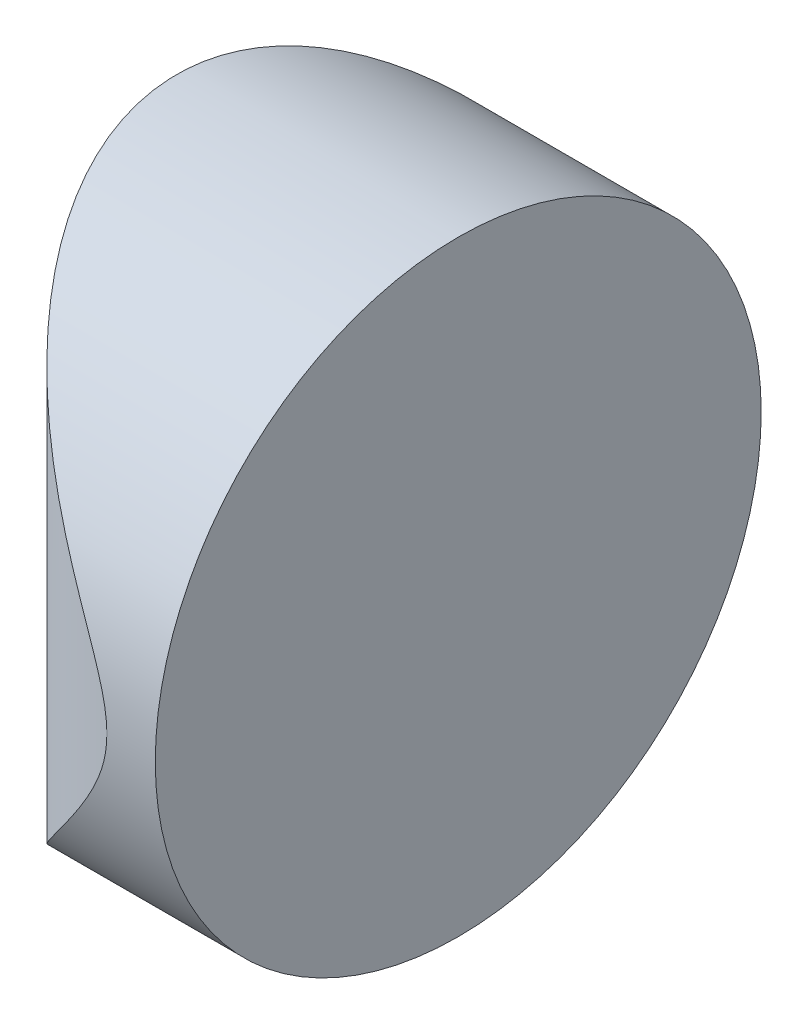
ISO-10303-21;
HEADER;
FILE_DESCRIPTION(('STEP AP214'),'2;1');
FILE_NAME('part.step','',(''),(''),'','','');
FILE_SCHEMA(('AUTOMOTIVE_DESIGN { 1 0 10303 214 1 1 1 1 }'));
ENDSEC;
DATA;
#1=APPLICATION_CONTEXT('core data for automotive mechanical design processes');
#2=APPLICATION_PROTOCOL_DEFINITION('international standard','automotive_design',2000,#1);
#3=PRODUCT_CONTEXT('',#1,'mechanical');
#4=PRODUCT('Part','Part','',(#3));
#5=PRODUCT_RELATED_PRODUCT_CATEGORY('part','',(#4));
#6=PRODUCT_DEFINITION_FORMATION('','',#4);
#7=PRODUCT_DEFINITION_CONTEXT('part definition',#1,'design');
#8=PRODUCT_DEFINITION('design','',#6,#7);
#9=PRODUCT_DEFINITION_SHAPE('','',#8);
#10=(LENGTH_UNIT() NAMED_UNIT(*) SI_UNIT(.MILLI.,.METRE.));
#11=(NAMED_UNIT(*) PLANE_ANGLE_UNIT() SI_UNIT($,.RADIAN.));
#12=(NAMED_UNIT(*) SI_UNIT($,.STERADIAN.) SOLID_ANGLE_UNIT());
#13=UNCERTAINTY_MEASURE_WITH_UNIT(LENGTH_MEASURE(1.E-05),#10,'distance_accuracy_value','');
#14=(GEOMETRIC_REPRESENTATION_CONTEXT(3) GLOBAL_UNCERTAINTY_ASSIGNED_CONTEXT((#13)) GLOBAL_UNIT_ASSIGNED_CONTEXT((#10,
#11,#12)) REPRESENTATION_CONTEXT('',''));
#15=CARTESIAN_POINT('',(0.,0.,0.));
#16=DIRECTION('',(0.,0.,1.));
#17=DIRECTION('',(1.,0.,0.));
#18=AXIS2_PLACEMENT_3D('',#15,#16,#17);
#19=CARTESIAN_POINT('',(4.35520433485127,25.,0.));
#20=DIRECTION('',(0.,-1.,0.));
#21=DIRECTION('',(0.,0.,-1.));
#22=AXIS2_PLACEMENT_3D('',#19,#20,#21);
#23=CYLINDRICAL_SURFACE('',#22,12.93);
#24=CARTESIAN_POINT('',(-8.57479566514873,0.,0.));
#25=CARTESIAN_POINT('',(-8.5747929937709,2.68088493961437E-06,-0.282174533499883));
#26=CARTESIAN_POINT('',(-8.56553846275083,0.00957491025996812,-0.564400892203769));
#27=CARTESIAN_POINT('',(-8.52871296274704,0.0476729836055615,-1.12649160579163));
#28=CARTESIAN_POINT('',(-8.50113157722261,0.0762096064799286,-1.40635452569037));
#29=CARTESIAN_POINT('',(-8.42817539550715,0.151721076945949,-1.96181739669201));
#30=CARTESIAN_POINT('',(-8.38276395615611,0.198733895795286,-2.23740734603856));
#31=CARTESIAN_POINT('',(-8.27509748122722,0.310256973788613,-2.78160368912727));
#32=CARTESIAN_POINT('',(-8.21284443778505,0.374765163467353,-3.05021090471678));
#33=CARTESIAN_POINT('',(-8.07318075960821,0.519590142946698,-3.57684708561456));
#34=CARTESIAN_POINT('',(-7.99588224691571,0.599790016744632,-3.83493818942344));
#35=CARTESIAN_POINT('',(-7.82714800420038,0.77501103633592,-4.34124519397043));
#36=CARTESIAN_POINT('',(-7.7357121849706,0.870032275652673,-4.58946103238282));
#37=CARTESIAN_POINT('',(-7.5400873926061,1.07354592733696,-5.07497966128007));
#38=CARTESIAN_POINT('',(-7.43590220860167,1.18203433737858,-5.31228566547903));
#39=CARTESIAN_POINT('',(-7.21608959678984,1.41122212505577,-5.77544828042821));
#40=CARTESIAN_POINT('',(-7.10045952225497,1.53192432737868,-6.00130222444472));
#41=CARTESIAN_POINT('',(-6.80966250336947,1.83594585320271,-6.53112386508007));
#42=CARTESIAN_POINT('',(-6.62948849474443,2.02468356875151,-6.82925657599115));
#43=CARTESIAN_POINT('',(-6.25234462683802,2.42086908827099,-7.40150919707761));
#44=CARTESIAN_POINT('',(-6.05536873184762,2.62832361740365,-7.67562040575768));
#45=CARTESIAN_POINT('',(-5.64715280596811,3.0598116425457,-8.20052147299852));
#46=CARTESIAN_POINT('',(-5.43587864917167,3.2838849343804,-8.45125187868297));
#47=CARTESIAN_POINT('',(-5.0022387397586,3.74596063630827,-8.92901134680167));
#48=CARTESIAN_POINT('',(-4.77987352943067,3.9839623654794,-9.15604156636317));
#49=CARTESIAN_POINT('',(-4.24741931307631,4.55737740361685,-9.66217918370357));
#50=CARTESIAN_POINT('',(-3.9337708742002,4.89782714771996,-9.9318533808449));
#51=CARTESIAN_POINT('',(-3.29622867509335,5.59848316464553,-10.430930949811));
#52=CARTESIAN_POINT('',(-2.97232846825909,5.95870197766204,-10.6603083632937));
#53=CARTESIAN_POINT('',(-2.48394611027726,6.51280166288943,-10.9748991050053));
#54=CARTESIAN_POINT('',(-2.32082138738664,6.69968906733892,-11.0748027496102));
#55=CARTESIAN_POINT('',(-1.99461676614496,7.07831977910787,-11.2650028572246));
#56=CARTESIAN_POINT('',(-1.83153686503378,7.27006263243405,-11.3553002143629));
#57=CARTESIAN_POINT('',(-1.50674578895956,7.65862352002389,-11.526322049042));
#58=CARTESIAN_POINT('',(-1.34503367274592,7.8554376092987,-11.6070537095459));
#59=CARTESIAN_POINT('',(-1.02449220999983,8.25494205939588,-11.7590467438197));
#60=CARTESIAN_POINT('',(-0.865662276898118,8.45763120224044,-11.830310063639));
#61=CARTESIAN_POINT('',(-0.604279741714042,8.80273595775245,-11.9415874374855));
#62=CARTESIAN_POINT('',(-0.500285599091823,8.94322166278295,-11.9842071019416));
#63=CARTESIAN_POINT('',(-0.295752137863434,9.2279480370596,-12.0650564366672));
#64=CARTESIAN_POINT('',(-0.195212951773189,9.37218884996197,-12.1032859386821));
#65=CARTESIAN_POINT('',(0.00092443895648781,9.66509097343334,-12.1752224193789));
#66=CARTESIAN_POINT('',(0.0965233834397294,9.81375161681082,-12.2089300764597));
#67=CARTESIAN_POINT('',(0.280610557102483,10.1163501912416,-12.2715954975027));
#68=CARTESIAN_POINT('',(0.369100939210886,10.27028650418,-12.3005547023884));
#69=CARTESIAN_POINT('',(0.56512028898972,10.6392620484239,-12.3626034265018));
#70=CARTESIAN_POINT('',(0.668539117652085,10.8569021940527,-12.3936160543599));
#71=CARTESIAN_POINT('',(0.845130874355471,11.3052372614093,-12.4447927365875));
#72=CARTESIAN_POINT('',(0.918418710606437,11.5358786990701,-12.4649980962693));
#73=CARTESIAN_POINT('',(0.994873758630041,11.8912307926981,-12.4857432246926));
#74=CARTESIAN_POINT('',(1.01479709369796,12.0120627862216,-12.4910671386201));
#75=CARTESIAN_POINT('',(1.04155977043179,12.2552671501683,-12.4981944474008));
#76=CARTESIAN_POINT('',(1.04840536258693,12.3776387565701,-12.4999995240859));
#77=CARTESIAN_POINT('',(1.04841094162754,12.6098474241097,-12.5000004272426));
#78=CARTESIAN_POINT('',(1.04289894973816,12.719686496492,-12.4985464904382));
#79=CARTESIAN_POINT('',(1.02127069789796,12.9382596044455,-12.4927941488805));
#80=CARTESIAN_POINT('',(1.00514941361761,13.0469930916487,-12.4884943964056));
#81=CARTESIAN_POINT('',(0.942232558778627,13.370783302532,-12.4715049064934));
#82=CARTESIAN_POINT('',(0.880892646084686,13.5828444347622,-12.4547261524281));
#83=CARTESIAN_POINT('',(0.744302550009602,13.9591379231231,-12.4157295363931));
#84=CARTESIAN_POINT('',(0.673394344757178,14.1252240877297,-12.3949866844521));
#85=CARTESIAN_POINT('',(0.518642894579129,14.4505707674582,-12.3479656670183));
#86=CARTESIAN_POINT('',(0.434787465913039,14.6098246709425,-12.3216822791093));
#87=CARTESIAN_POINT('',(0.257847706028198,14.9228447633499,-12.2639824117418));
#88=CARTESIAN_POINT('',(0.164730675265344,15.0765886991344,-12.2325474714109));
#89=CARTESIAN_POINT('',(-0.027690647385843,15.3789635082635,-12.1649308845943));
#90=CARTESIAN_POINT('',(-0.126992856777576,15.5275960766803,-12.1287508312596));
#91=CARTESIAN_POINT('',(-0.349568920007536,15.8490218418852,-12.0443666806837));
#92=CARTESIAN_POINT('',(-0.473761266102093,16.0209205473671,-11.9951908569512));
#93=CARTESIAN_POINT('',(-0.726150336249675,16.3597872665038,-11.8904774857763));
#94=CARTESIAN_POINT('',(-0.854347889460638,16.5267542450869,-11.8349386146232));
#95=CARTESIAN_POINT('',(-1.24281416143181,17.0216308040998,-11.6588061907795));
#96=CARTESIAN_POINT('',(-1.5068014989186,17.3433003586199,-11.5287542167961));
#97=CARTESIAN_POINT('',(-2.03705147659641,17.9730618234241,-11.2434365302485));
#98=CARTESIAN_POINT('',(-2.30331363169608,18.2811565462365,-11.0881760720824));
#99=CARTESIAN_POINT('',(-2.83362900953397,18.8847605323907,-10.7519352312504));
#100=CARTESIAN_POINT('',(-3.0976830511054,19.1802746439274,-10.5709648751876));
#101=CARTESIAN_POINT('',(-3.62517928351127,19.7641241086607,-10.1788251584824));
#102=CARTESIAN_POINT('',(-3.88851392926032,20.0522153540762,-9.96714604285965));
#103=CARTESIAN_POINT('',(-4.40615079611728,20.6140835432566,-9.51533528956945));
#104=CARTESIAN_POINT('',(-4.66045113921757,20.8878575163343,-9.27519778057146));
#105=CARTESIAN_POINT('',(-5.15622107394873,21.4185900145791,-8.76605700463498));
#106=CARTESIAN_POINT('',(-5.39771104233148,21.6755754050003,-8.49710176861403));
#107=CARTESIAN_POINT('',(-5.86474289689296,22.1705287227006,-7.92922950782493));
#108=CARTESIAN_POINT('',(-6.09028414392442,22.4084958878712,-7.63031128344496));
#109=CARTESIAN_POINT('',(-6.4608386158455,22.798273218017,-7.09036317288929));
#110=CARTESIAN_POINT('',(-6.61070748110892,22.9555406611425,-6.85658310716572));
#111=CARTESIAN_POINT('',(-6.89831418420749,23.2568020763273,-6.37355353634184));
#112=CARTESIAN_POINT('',(-7.03605524247912,23.4007995725853,-6.12430816807198));
#113=CARTESIAN_POINT('',(-7.29753812846116,23.6737656564494,-5.61083435208353));
#114=CARTESIAN_POINT('',(-7.42128634570595,23.8027411043707,-5.34661282633209));
#115=CARTESIAN_POINT('',(-7.65289552431596,24.043859236649,-4.80389715473865));
#116=CARTESIAN_POINT('',(-7.76075938247565,24.1560049902705,-4.52540562380319));
#117=CARTESIAN_POINT('',(-7.94323698019926,24.3455607506586,-3.99977000567084));
#118=CARTESIAN_POINT('',(-8.020412949623,24.4256604591053,-3.7544832093359));
#119=CARTESIAN_POINT('',(-8.16086264384466,24.5713465512937,-3.25577032070347));
#120=CARTESIAN_POINT('',(-8.22413905642464,24.6369357409779,-3.00234581289248));
#121=CARTESIAN_POINT('',(-8.33563005001268,24.7524530344486,-2.48925827328166));
#122=CARTESIAN_POINT('',(-8.38387515823587,24.8024128808704,-2.22960905436976));
#123=CARTESIAN_POINT('',(-8.46458105378723,24.8859644259062,-1.70536566050145));
#124=CARTESIAN_POINT('',(-8.49704956504806,24.9195641341607,-1.44077397131144));
#125=CARTESIAN_POINT('',(-8.53908605729265,24.9630592547352,-0.980007194536267));
#126=CARTESIAN_POINT('',(-8.55246203297048,24.9768969197898,-0.784536320775911));
#127=CARTESIAN_POINT('',(-8.57031861749561,24.9953691057738,-0.392718771415941));
#128=CARTESIAN_POINT('',(-8.57479752422379,25.0000018656913,-0.19637193543369));
#129=CARTESIAN_POINT('',(-8.5747929937709,24.9999973191151,0.28217453349989));
#130=CARTESIAN_POINT('',(-8.56553846275083,24.99042508974,0.564400892203776));
#131=CARTESIAN_POINT('',(-8.52871296274703,24.9523270163944,1.12649160579164));
#132=CARTESIAN_POINT('',(-8.50113157722261,24.9237903935201,1.40635452569037));
#133=CARTESIAN_POINT('',(-8.42817539550714,24.848278923054,1.96181739669202));
#134=CARTESIAN_POINT('',(-8.38276395615611,24.8012661042047,2.23740734603857));
#135=CARTESIAN_POINT('',(-8.27509748122722,24.6897430262114,2.78160368912727));
#136=CARTESIAN_POINT('',(-8.21284443778505,24.6252348365326,3.05021090471679));
#137=CARTESIAN_POINT('',(-8.0731807596082,24.4804098570533,3.57684708561457));
#138=CARTESIAN_POINT('',(-7.99588224691571,24.4002099832554,3.83493818942345));
#139=CARTESIAN_POINT('',(-7.82714800420037,24.2249889636641,4.34124519397044));
#140=CARTESIAN_POINT('',(-7.7357121849706,24.1299677243473,4.58946103238283));
#141=CARTESIAN_POINT('',(-7.54008739260609,23.926454072663,5.07497966128007));
#142=CARTESIAN_POINT('',(-7.43590220860166,23.8179656626214,5.31228566547904));
#143=CARTESIAN_POINT('',(-7.21608959678984,23.5887778749442,5.77544828042822));
#144=CARTESIAN_POINT('',(-7.10045952225497,23.4680756726213,6.00130222444472));
#145=CARTESIAN_POINT('',(-6.80966250336947,23.1640541467973,6.53112386508007));
#146=CARTESIAN_POINT('',(-6.62948849474443,22.9753164312485,6.82925657599116));
#147=CARTESIAN_POINT('',(-6.25234462683801,22.579130911729,7.40150919707761));
#148=CARTESIAN_POINT('',(-6.05536873184762,22.3716763825963,7.67562040575769));
#149=CARTESIAN_POINT('',(-5.64715280596811,21.9401883574543,8.20052147299852));
#150=CARTESIAN_POINT('',(-5.43587864917167,21.7161150656196,8.45125187868297));
#151=CARTESIAN_POINT('',(-5.0022387397586,21.2540393636917,8.92901134680167));
#152=CARTESIAN_POINT('',(-4.77987352943067,21.0160376345206,9.15604156636318));
#153=CARTESIAN_POINT('',(-4.24741931307631,20.4426225963832,9.66217918370358));
#154=CARTESIAN_POINT('',(-3.93377087420019,20.10217285228,9.93185338084491));
#155=CARTESIAN_POINT('',(-3.29622867509334,19.4015168353545,10.430930949811));
#156=CARTESIAN_POINT('',(-2.97232846825909,19.041298022338,10.6603083632937));
#157=CARTESIAN_POINT('',(-2.48394611027726,18.4871983371106,10.9748991050053));
#158=CARTESIAN_POINT('',(-2.32082138738663,18.3003109326611,11.0748027496102));
#159=CARTESIAN_POINT('',(-1.99461676614495,17.9216802208921,11.2650028572246));
#160=CARTESIAN_POINT('',(-1.83153686503377,17.729937367566,11.3553002143629));
#161=CARTESIAN_POINT('',(-1.50674578895956,17.3413764799761,11.526322049042));
#162=CARTESIAN_POINT('',(-1.34503367274592,17.1445623907013,11.6070537095459));
#163=CARTESIAN_POINT('',(-1.02449220999982,16.7450579406041,11.7590467438197));
#164=CARTESIAN_POINT('',(-0.865662276898113,16.5423687977596,11.830310063639));
#165=CARTESIAN_POINT('',(-0.604279741714038,16.1972640422476,11.9415874374855));
#166=CARTESIAN_POINT('',(-0.500285599091822,16.0567783372171,11.9842071019416));
#167=CARTESIAN_POINT('',(-0.295752137863437,15.7720519629404,12.0650564366672));
#168=CARTESIAN_POINT('',(-0.195212951773195,15.627811150038,12.1032859386821));
#169=CARTESIAN_POINT('',(0.000924438956481576,15.3349090265667,12.1752224193789));
#170=CARTESIAN_POINT('',(0.0965233834397256,15.1862483831892,12.2089300764597));
#171=CARTESIAN_POINT('',(0.280610557102484,14.8836498087584,12.2715954975027));
#172=CARTESIAN_POINT('',(0.369100939210888,14.72971349582,12.3005547023884));
#173=CARTESIAN_POINT('',(0.565120288989722,14.3607379515761,12.3626034265018));
#174=CARTESIAN_POINT('',(0.668539117652083,14.1430978059473,12.3936160543599));
#175=CARTESIAN_POINT('',(0.845130874355469,13.6947627385907,12.4447927365875));
#176=CARTESIAN_POINT('',(0.918418710606439,13.4641213009299,12.4649980962693));
#177=CARTESIAN_POINT('',(0.994873758630045,13.1087692073019,12.4857432246926));
#178=CARTESIAN_POINT('',(1.01479709369796,12.9879372137784,12.4910671386201));
#179=CARTESIAN_POINT('',(1.04155977043179,12.7447328498317,12.4981944474008));
#180=CARTESIAN_POINT('',(1.04840536258693,12.6223612434299,12.4999995240859));
#181=CARTESIAN_POINT('',(1.04841094162754,12.3901525758903,12.5000004272426));
#182=CARTESIAN_POINT('',(1.04289894973816,12.280313503508,12.4985464904382));
#183=CARTESIAN_POINT('',(1.02127069789796,12.0617403955545,12.4927941488805));
#184=CARTESIAN_POINT('',(1.00514941361761,11.9530069083513,12.4884943964056));
#185=CARTESIAN_POINT('',(0.942232558778628,11.629216697468,12.4715049064934));
#186=CARTESIAN_POINT('',(0.880892646084688,11.4171555652378,12.4547261524281));
#187=CARTESIAN_POINT('',(0.744302550009601,11.0408620768769,12.4157295363931));
#188=CARTESIAN_POINT('',(0.673394344757175,10.8747759122703,12.3949866844521));
#189=CARTESIAN_POINT('',(0.518642894579126,10.5494292325418,12.3479656670183));
#190=CARTESIAN_POINT('',(0.434787465913039,10.3901753290576,12.3216822791093));
#191=CARTESIAN_POINT('',(0.2578477060282,10.0771552366501,12.2639824117418));
#192=CARTESIAN_POINT('',(0.164730675265343,9.92341130086564,12.2325474714109));
#193=CARTESIAN_POINT('',(-0.0276906473858463,9.6210364917365,12.1649308845943));
#194=CARTESIAN_POINT('',(-0.126992856777578,9.47240392331971,12.1287508312596));
#195=CARTESIAN_POINT('',(-0.349568920007536,9.15097815811478,12.0443666806837));
#196=CARTESIAN_POINT('',(-0.473761266102091,8.97907945263286,11.9951908569512));
#197=CARTESIAN_POINT('',(-0.72615033624967,8.64021273349622,11.8904774857763));
#198=CARTESIAN_POINT('',(-0.85434788946063,8.47324575491308,11.8349386146233));
#199=CARTESIAN_POINT('',(-1.2428141614318,7.97836919590025,11.6588061907795));
#200=CARTESIAN_POINT('',(-1.50680149891859,7.65669964138006,11.5287542167961));
#201=CARTESIAN_POINT('',(-2.03705147659639,7.02693817657595,11.2434365302485));
#202=CARTESIAN_POINT('',(-2.30331363169607,6.71884345376348,11.0881760720825));
#203=CARTESIAN_POINT('',(-2.83362900953396,6.11523946760926,10.7519352312504));
#204=CARTESIAN_POINT('',(-3.0976830511054,5.81972535607258,10.5709648751876));
#205=CARTESIAN_POINT('',(-3.62517928351126,5.23587589133932,10.1788251584824));
#206=CARTESIAN_POINT('',(-3.88851392926031,4.94778464592383,9.96714604285966));
#207=CARTESIAN_POINT('',(-4.40615079611727,4.3859164567434,9.51533528956946));
#208=CARTESIAN_POINT('',(-4.66045113921756,4.11214248366567,9.27519778057147));
#209=CARTESIAN_POINT('',(-5.15622107394873,3.58140998542088,8.76605700463498));
#210=CARTESIAN_POINT('',(-5.39771104233148,3.32442459499966,8.49710176861404));
#211=CARTESIAN_POINT('',(-5.86474289689296,2.82947127729944,7.92922950782493));
#212=CARTESIAN_POINT('',(-6.09028414392442,2.59150411212881,7.63031128344497));
#213=CARTESIAN_POINT('',(-6.46083861584549,2.20172678198299,7.0903631728893));
#214=CARTESIAN_POINT('',(-6.61070748110891,2.04445933885752,6.85658310716572));
#215=CARTESIAN_POINT('',(-6.89831418420748,1.74319792367268,6.37355353634185));
#216=CARTESIAN_POINT('',(-7.03605524247912,1.59920042741475,6.12430816807199));
#217=CARTESIAN_POINT('',(-7.29753812846116,1.32623434355057,5.61083435208354));
#218=CARTESIAN_POINT('',(-7.42128634570595,1.19725889562934,5.34661282633209));
#219=CARTESIAN_POINT('',(-7.65289552431596,0.956140763351015,4.80389715473865));
#220=CARTESIAN_POINT('',(-7.76075938247565,0.84399500972953,4.5254056238032));
#221=CARTESIAN_POINT('',(-7.94323698019926,0.654439249341414,3.99977000567085));
#222=CARTESIAN_POINT('',(-8.020412949623,0.574339540894724,3.75448320933591));
#223=CARTESIAN_POINT('',(-8.16086264384465,0.428653448706266,3.25577032070347));
#224=CARTESIAN_POINT('',(-8.22413905642464,0.363064259022072,3.00234581289248));
#225=CARTESIAN_POINT('',(-8.33563005001268,0.247546965551438,2.48925827328166));
#226=CARTESIAN_POINT('',(-8.38387515823586,0.197587119129626,2.22960905436977));
#227=CARTESIAN_POINT('',(-8.46458105378723,0.114035574093826,1.70536566050146));
#228=CARTESIAN_POINT('',(-8.49704956504806,0.0804358658393486,1.44077397131145));
#229=CARTESIAN_POINT('',(-8.53908605729265,0.0369407452647772,0.980007194536275));
#230=CARTESIAN_POINT('',(-8.55246203297048,0.0231030802102291,0.784536320775918));
#231=CARTESIAN_POINT('',(-8.57031861749561,0.0046308942262215,0.392718771415947));
#232=CARTESIAN_POINT('',(-8.57479752422379,-1.86569128059798E-06,0.196371935433696));
#233=CARTESIAN_POINT('',(-8.57479566514873,0.,0.));
#234=B_SPLINE_CURVE_WITH_KNOTS('',3,(#24,#25,#26,#27,#28,#29,#30,#31,#32,#33,#34,#35,#36,#37,
#38,#39,#40,#41,#42,#43,#44,#45,#46,#47,#48,#49,#50,#51,#52,#53,#54,#55,#56,#57,#58,#59,#60,#61,
#62,#63,#64,#65,#66,#67,#68,#69,#70,#71,#72,#73,#74,#75,#76,#77,#78,#79,#80,#81,#82,#83,#84,#85,
#86,#87,#88,#89,#90,#91,#92,#93,#94,#95,#96,#97,#98,#99,#100,#101,#102,#103,#104,#105,#106,#107,
#108,#109,#110,#111,#112,#113,#114,#115,#116,#117,#118,#119,#120,#121,#122,#123,#124,#125,#126,
#127,#128,#129,#130,#131,#132,#133,#134,#135,#136,#137,#138,#139,#140,#141,#142,#143,#144,#145,
#146,#147,#148,#149,#150,#151,#152,#153,#154,#155,#156,#157,#158,#159,#160,#161,#162,#163,#164,
#165,#166,#167,#168,#169,#170,#171,#172,#173,#174,#175,#176,#177,#178,#179,#180,#181,#182,#183,
#184,#185,#186,#187,#188,#189,#190,#191,#192,#193,#194,#195,#196,#197,#198,#199,#200,#201,#202,
#203,#204,#205,#206,#207,#208,#209,#210,#211,#212,#213,#214,#215,#216,#217,#218,#219,#220,#221,
#222,#223,#224,#225,#226,#227,#228,#229,#230,#231,#232,#233),.UNSPECIFIED.,.T.,.F.,(4,2,2,2,2,2,
2,2,2,2,2,2,2,2,2,2,2,2,2,2,2,2,2,2,2,2,2,2,2,2,2,2,2,2,2,2,2,2,2,2,2,2,2,2,2,2,2,2,2,2,2,2,2,2,
2,2,2,2,2,2,2,2,2,2,2,2,2,2,2,2,2,2,2,2,2,2,2,2,2,2,2,2,2,2,2,2,2,2,2,2,2,2,2,2,2,2,2,2,2,2,2,2,
2,2,4),(0.,0.84630289783358,1.69308722568674,2.54162099562732,3.39005443926583,4.23239183662282,
5.07473454937694,5.9168275218651,6.75911569249255,7.94591897269669,9.13315039601834,
10.3233227875986,11.5134370435323,13.1184043724537,14.7244018265321,15.5265090590815,
16.3285415680755,17.1299679551477,17.9312293675935,18.4708556256148,19.010502558119,
19.5500684382294,20.0894702821789,20.816824950064,21.54137944034,21.9084581753725,
22.2753614216927,22.6047416680518,22.9342780140735,23.5950773649756,24.1396932286883,
24.6848247521088,25.2319543079406,25.7789006354218,26.4317537487309,27.0847429231223,
28.3915343041767,29.6980536495142,31.004064856992,32.3349633423084,33.6661368885991,
34.9951252811913,36.3241669030344,37.2807934448986,38.2371651917151,39.1930984528806,
40.1488571662045,40.9560330483867,41.7630527078584,42.5684225358659,43.3733976712934,
43.9622472420388,44.5512094561317,45.3975123539653,46.2442966818184,47.092830451759,
47.9412638953975,48.7836012927545,49.6259440055086,50.4680369779968,51.3103251486242,
52.4971284288284,53.68435985215,54.8745322437303,56.064646499664,57.6696138285854,
59.2756112826638,60.0777185152132,60.8797510242072,61.6811774112794,62.4824388237252,
63.0220650817464,63.5617120142507,64.1012778943611,64.6406797383106,65.3680344061956,
66.0925888964717,66.4596676315042,66.8265708778244,67.1559511241835,67.4854874702052,
68.1462868211073,68.69090268482,69.2360342082405,69.7831637640722,70.3301100915535,
70.9829632048626,71.635952379254,72.9427437603083,74.2492631056459,75.5552743131237,
76.8861727984401,78.2173463447308,79.546334737323,80.8753763591661,81.8320029010303,
82.7883746478468,83.7443079090123,84.7000666223362,85.5072425045184,86.3142621639901,
87.1196319919976,87.9246071274251,88.5134566981705,89.1024189122634),.UNSPECIFIED.);
#235=CARTESIAN_POINT('',(-8.57479566514873,0.,0.));
#236=VERTEX_POINT('',#235);
#237=EDGE_CURVE('E10',#236,#236,#234,.T.);
#238=ORIENTED_EDGE('',*,*,#237,.F.);
#239=EDGE_LOOP('',(#238));
#240=FACE_BOUND('',#239,.T.);
#241=ADVANCED_FACE('F35',(#240),#23,.T.);
#242=CARTESIAN_POINT('',(3.04520433485125,25.,-12.5));
#243=DIRECTION('',(1.,0.,0.));
#244=DIRECTION('',(0.,0.,-1.));
#245=AXIS2_PLACEMENT_3D('',#242,#243,#244);
#246=PLANE('',#245);
#247=CARTESIAN_POINT('',(3.04520433485126,12.5,0.));
#248=DIRECTION('',(1.,0.,0.));
#249=DIRECTION('',(0.,0.,-1.));
#250=AXIS2_PLACEMENT_3D('',#247,#248,#249);
#251=CIRCLE('',#250,12.5);
#252=CARTESIAN_POINT('',(3.04520433485125,12.5,-12.5));
#253=VERTEX_POINT('',#252);
#254=EDGE_CURVE('E45',#253,#253,#251,.T.);
#255=ORIENTED_EDGE('',*,*,#254,.T.);
#256=EDGE_LOOP('',(#255));
#257=FACE_BOUND('',#256,.T.);
#258=ADVANCED_FACE('F37',(#257),#246,.T.);
#259=CARTESIAN_POINT('',(-9.65479566514874,12.5,0.));
#260=DIRECTION('',(1.,0.,0.));
#261=DIRECTION('',(0.,0.,-1.));
#262=AXIS2_PLACEMENT_3D('',#259,#260,#261);
#263=CYLINDRICAL_SURFACE('',#262,12.5);
#264=ORIENTED_EDGE('',*,*,#254,.F.);
#265=EDGE_LOOP('',(#264));
#266=FACE_BOUND('',#265,.T.);
#267=ORIENTED_EDGE('',*,*,#237,.T.);
#268=EDGE_LOOP('',(#267));
#269=FACE_BOUND('',#268,.T.);
#270=ADVANCED_FACE('F52',(#266,#269),#263,.T.);
#271=CLOSED_SHELL('',(#241,#258,#270));
#272=MANIFOLD_SOLID_BREP('B2',#271);
#273=ADVANCED_BREP_SHAPE_REPRESENTATION('',(#18,#272),#14);
#274=SHAPE_DEFINITION_REPRESENTATION(#9,#273);
ENDSEC;
END-ISO-10303-21;
